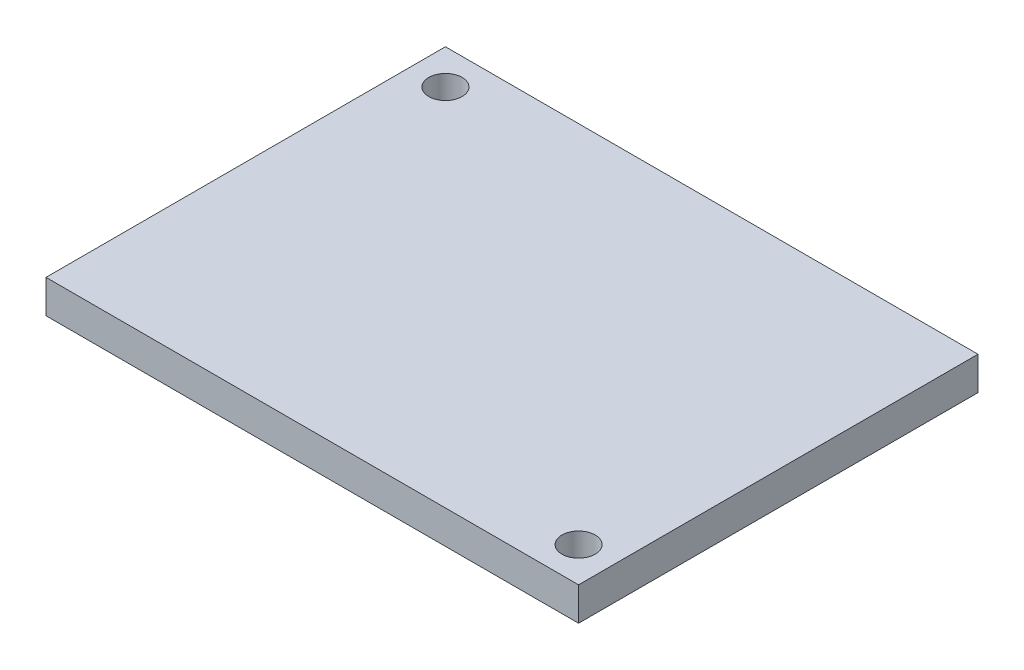
ISO-10303-21;
HEADER;
FILE_DESCRIPTION(('STEP AP214'),'2;1');
FILE_NAME('part.step','',(''),(''),'','','');
FILE_SCHEMA(('AUTOMOTIVE_DESIGN { 1 0 10303 214 1 1 1 1 }'));
ENDSEC;
DATA;
#1=APPLICATION_CONTEXT('core data for automotive mechanical design processes');
#2=APPLICATION_PROTOCOL_DEFINITION('international standard','automotive_design',2000,#1);
#3=PRODUCT_CONTEXT('',#1,'mechanical');
#4=PRODUCT('Part','Part','',(#3));
#5=PRODUCT_RELATED_PRODUCT_CATEGORY('part','',(#4));
#6=PRODUCT_DEFINITION_FORMATION('','',#4);
#7=PRODUCT_DEFINITION_CONTEXT('part definition',#1,'design');
#8=PRODUCT_DEFINITION('design','',#6,#7);
#9=PRODUCT_DEFINITION_SHAPE('','',#8);
#10=(LENGTH_UNIT() NAMED_UNIT(*) SI_UNIT(.MILLI.,.METRE.));
#11=(NAMED_UNIT(*) PLANE_ANGLE_UNIT() SI_UNIT($,.RADIAN.));
#12=(NAMED_UNIT(*) SI_UNIT($,.STERADIAN.) SOLID_ANGLE_UNIT());
#13=UNCERTAINTY_MEASURE_WITH_UNIT(LENGTH_MEASURE(1.E-05),#10,'distance_accuracy_value','');
#14=(GEOMETRIC_REPRESENTATION_CONTEXT(3) GLOBAL_UNCERTAINTY_ASSIGNED_CONTEXT((#13)) GLOBAL_UNIT_ASSIGNED_CONTEXT((#10,
#11,#12)) REPRESENTATION_CONTEXT('',''));
#15=CARTESIAN_POINT('',(0.,0.,0.));
#16=DIRECTION('',(0.,0.,1.));
#17=DIRECTION('',(1.,0.,0.));
#18=AXIS2_PLACEMENT_3D('',#15,#16,#17);
#19=CARTESIAN_POINT('',(0.,3.175,0.));
#20=DIRECTION('',(0.,-1.,0.));
#21=DIRECTION('',(0.,0.,-1.));
#22=AXIS2_PLACEMENT_3D('',#19,#20,#21);
#23=PLANE('',#22);
#24=DIRECTION('',(0.,0.,-1.));
#25=VECTOR('',#24,1.);
#26=CARTESIAN_POINT('',(25.4,3.175,19.05));
#27=LINE('',#26,#25);
#28=CARTESIAN_POINT('',(25.4,3.175,19.05));
#29=VERTEX_POINT('',#28);
#30=CARTESIAN_POINT('',(25.4,3.175,-19.05));
#31=VERTEX_POINT('',#30);
#32=EDGE_CURVE('E98',#29,#31,#27,.T.);
#33=ORIENTED_EDGE('',*,*,#32,.T.);
#34=DIRECTION('',(-1.,0.,0.));
#35=VECTOR('',#34,1.);
#36=CARTESIAN_POINT('',(-25.4,3.175,-19.05));
#37=LINE('',#36,#35);
#38=CARTESIAN_POINT('',(-25.4,3.175,-19.05));
#39=VERTEX_POINT('',#38);
#40=EDGE_CURVE('E93',#31,#39,#37,.T.);
#41=ORIENTED_EDGE('',*,*,#40,.T.);
#42=DIRECTION('',(0.,0.,1.));
#43=VECTOR('',#42,1.);
#44=CARTESIAN_POINT('',(-25.4,3.175,19.05));
#45=LINE('',#44,#43);
#46=CARTESIAN_POINT('',(-25.4,3.175,19.05));
#47=VERTEX_POINT('',#46);
#48=EDGE_CURVE('E96',#39,#47,#45,.T.);
#49=ORIENTED_EDGE('',*,*,#48,.T.);
#50=DIRECTION('',(1.,0.,0.));
#51=VECTOR('',#50,1.);
#52=CARTESIAN_POINT('',(-25.4,3.175,19.05));
#53=LINE('',#52,#51);
#54=EDGE_CURVE('E63',#47,#29,#53,.T.);
#55=ORIENTED_EDGE('',*,*,#54,.T.);
#56=EDGE_LOOP('',(#33,#41,#49,#55));
#57=FACE_BOUND('',#56,.T.);
#58=CARTESIAN_POINT('',(-22.07514,3.175,-15.72514));
#59=DIRECTION('',(0.,1.,0.));
#60=DIRECTION('',(0.,0.,1.));
#61=AXIS2_PLACEMENT_3D('',#58,#59,#60);
#62=CIRCLE('',#61,1.5875);
#63=CARTESIAN_POINT('',(-22.07514,3.175,-14.13764));
#64=VERTEX_POINT('',#63);
#65=EDGE_CURVE('E118',#64,#64,#62,.T.);
#66=ORIENTED_EDGE('',*,*,#65,.F.);
#67=EDGE_LOOP('',(#66));
#68=FACE_BOUND('',#67,.T.);
#69=CARTESIAN_POINT('',(22.07514,3.175,15.72514));
#70=DIRECTION('',(0.,1.,0.));
#71=DIRECTION('',(0.,0.,1.));
#72=AXIS2_PLACEMENT_3D('',#69,#70,#71);
#73=CIRCLE('',#72,1.5875);
#74=CARTESIAN_POINT('',(22.07514,3.175,17.31264));
#75=VERTEX_POINT('',#74);
#76=EDGE_CURVE('E140',#75,#75,#73,.T.);
#77=ORIENTED_EDGE('',*,*,#76,.F.);
#78=EDGE_LOOP('',(#77));
#79=FACE_BOUND('',#78,.T.);
#80=ADVANCED_FACE('F45',(#57,#68,#79),#23,.F.);
#81=CARTESIAN_POINT('',(0.,0.,0.));
#82=DIRECTION('',(0.,-1.,0.));
#83=DIRECTION('',(0.,0.,-1.));
#84=AXIS2_PLACEMENT_3D('',#81,#82,#83);
#85=PLANE('',#84);
#86=CARTESIAN_POINT('',(-22.07514,0.,-15.72514));
#87=DIRECTION('',(0.,1.,0.));
#88=DIRECTION('',(0.,0.,1.));
#89=AXIS2_PLACEMENT_3D('',#86,#87,#88);
#90=CIRCLE('',#89,1.5875);
#91=CARTESIAN_POINT('',(-22.07514,0.,-14.13764));
#92=VERTEX_POINT('',#91);
#93=EDGE_CURVE('E136',#92,#92,#90,.T.);
#94=ORIENTED_EDGE('',*,*,#93,.T.);
#95=EDGE_LOOP('',(#94));
#96=FACE_BOUND('',#95,.T.);
#97=DIRECTION('',(0.,0.,-1.));
#98=VECTOR('',#97,1.);
#99=CARTESIAN_POINT('',(25.4,0.,19.05));
#100=LINE('',#99,#98);
#101=CARTESIAN_POINT('',(25.4,0.,19.05));
#102=VERTEX_POINT('',#101);
#103=CARTESIAN_POINT('',(25.4,0.,-19.05));
#104=VERTEX_POINT('',#103);
#105=EDGE_CURVE('E114',#102,#104,#100,.T.);
#106=ORIENTED_EDGE('',*,*,#105,.F.);
#107=DIRECTION('',(1.,0.,0.));
#108=VECTOR('',#107,1.);
#109=CARTESIAN_POINT('',(-25.4,0.,19.05));
#110=LINE('',#109,#108);
#111=CARTESIAN_POINT('',(-25.4,0.,19.05));
#112=VERTEX_POINT('',#111);
#113=EDGE_CURVE('E86',#112,#102,#110,.T.);
#114=ORIENTED_EDGE('',*,*,#113,.F.);
#115=DIRECTION('',(0.,0.,1.));
#116=VECTOR('',#115,1.);
#117=CARTESIAN_POINT('',(-25.4,0.,19.05));
#118=LINE('',#117,#116);
#119=CARTESIAN_POINT('',(-25.4,0.,-19.05));
#120=VERTEX_POINT('',#119);
#121=EDGE_CURVE('E80',#120,#112,#118,.T.);
#122=ORIENTED_EDGE('',*,*,#121,.F.);
#123=DIRECTION('',(-1.,0.,0.));
#124=VECTOR('',#123,1.);
#125=CARTESIAN_POINT('',(-25.4,0.,-19.05));
#126=LINE('',#125,#124);
#127=EDGE_CURVE('E103',#104,#120,#126,.T.);
#128=ORIENTED_EDGE('',*,*,#127,.F.);
#129=EDGE_LOOP('',(#106,#114,#122,#128));
#130=FACE_BOUND('',#129,.T.);
#131=CARTESIAN_POINT('',(22.07514,0.,15.72514));
#132=DIRECTION('',(0.,1.,0.));
#133=DIRECTION('',(0.,0.,1.));
#134=AXIS2_PLACEMENT_3D('',#131,#132,#133);
#135=CIRCLE('',#134,1.5875);
#136=CARTESIAN_POINT('',(22.07514,0.,17.31264));
#137=VERTEX_POINT('',#136);
#138=EDGE_CURVE('E144',#137,#137,#135,.T.);
#139=ORIENTED_EDGE('',*,*,#138,.T.);
#140=EDGE_LOOP('',(#139));
#141=FACE_BOUND('',#140,.T.);
#142=ADVANCED_FACE('F131',(#96,#130,#141),#85,.T.);
#143=CARTESIAN_POINT('',(25.4,3.175,19.05));
#144=DIRECTION('',(-1.,0.,0.));
#145=DIRECTION('',(0.,0.,1.));
#146=AXIS2_PLACEMENT_3D('',#143,#144,#145);
#147=PLANE('',#146);
#148=ORIENTED_EDGE('',*,*,#105,.T.);
#149=DIRECTION('',(0.,-1.,0.));
#150=VECTOR('',#149,1.);
#151=CARTESIAN_POINT('',(25.4,3.175,-19.05));
#152=LINE('',#151,#150);
#153=EDGE_CURVE('E11',#31,#104,#152,.T.);
#154=ORIENTED_EDGE('',*,*,#153,.F.);
#155=ORIENTED_EDGE('',*,*,#32,.F.);
#156=DIRECTION('',(0.,-1.,0.));
#157=VECTOR('',#156,1.);
#158=CARTESIAN_POINT('',(25.4,3.175,19.05));
#159=LINE('',#158,#157);
#160=EDGE_CURVE('E110',#29,#102,#159,.T.);
#161=ORIENTED_EDGE('',*,*,#160,.T.);
#162=EDGE_LOOP('',(#148,#154,#155,#161));
#163=FACE_BOUND('',#162,.T.);
#164=ADVANCED_FACE('F47',(#163),#147,.F.);
#165=CARTESIAN_POINT('',(-25.4,3.175,-19.05));
#166=DIRECTION('',(0.,0.,1.));
#167=DIRECTION('',(1.,0.,0.));
#168=AXIS2_PLACEMENT_3D('',#165,#166,#167);
#169=PLANE('',#168);
#170=ORIENTED_EDGE('',*,*,#127,.T.);
#171=DIRECTION('',(0.,-1.,0.));
#172=VECTOR('',#171,1.);
#173=CARTESIAN_POINT('',(-25.4,3.175,-19.05));
#174=LINE('',#173,#172);
#175=EDGE_CURVE('E55',#39,#120,#174,.T.);
#176=ORIENTED_EDGE('',*,*,#175,.F.);
#177=ORIENTED_EDGE('',*,*,#40,.F.);
#178=ORIENTED_EDGE('',*,*,#153,.T.);
#179=EDGE_LOOP('',(#170,#176,#177,#178));
#180=FACE_BOUND('',#179,.T.);
#181=ADVANCED_FACE('F102',(#180),#169,.F.);
#182=CARTESIAN_POINT('',(-25.4,3.175,19.05));
#183=DIRECTION('',(1.,0.,0.));
#184=DIRECTION('',(0.,0.,-1.));
#185=AXIS2_PLACEMENT_3D('',#182,#183,#184);
#186=PLANE('',#185);
#187=ORIENTED_EDGE('',*,*,#121,.T.);
#188=DIRECTION('',(0.,-1.,0.));
#189=VECTOR('',#188,1.);
#190=CARTESIAN_POINT('',(-25.4,3.175,19.05));
#191=LINE('',#190,#189);
#192=EDGE_CURVE('E105',#47,#112,#191,.T.);
#193=ORIENTED_EDGE('',*,*,#192,.F.);
#194=ORIENTED_EDGE('',*,*,#48,.F.);
#195=ORIENTED_EDGE('',*,*,#175,.T.);
#196=EDGE_LOOP('',(#187,#193,#194,#195));
#197=FACE_BOUND('',#196,.T.);
#198=ADVANCED_FACE('F106',(#197),#186,.F.);
#199=CARTESIAN_POINT('',(-25.4,3.175,19.05));
#200=DIRECTION('',(0.,0.,-1.));
#201=DIRECTION('',(-1.,0.,0.));
#202=AXIS2_PLACEMENT_3D('',#199,#200,#201);
#203=PLANE('',#202);
#204=ORIENTED_EDGE('',*,*,#113,.T.);
#205=ORIENTED_EDGE('',*,*,#160,.F.);
#206=ORIENTED_EDGE('',*,*,#54,.F.);
#207=ORIENTED_EDGE('',*,*,#192,.T.);
#208=EDGE_LOOP('',(#204,#205,#206,#207));
#209=FACE_BOUND('',#208,.T.);
#210=ADVANCED_FACE('F128',(#209),#203,.F.);
#211=CARTESIAN_POINT('',(-22.07514,3.175,-15.72514));
#212=DIRECTION('',(0.,-1.,0.));
#213=DIRECTION('',(0.,0.,-1.));
#214=AXIS2_PLACEMENT_3D('',#211,#212,#213);
#215=CYLINDRICAL_SURFACE('',#214,1.5875);
#216=ORIENTED_EDGE('',*,*,#65,.T.);
#217=EDGE_LOOP('',(#216));
#218=FACE_BOUND('',#217,.T.);
#219=ORIENTED_EDGE('',*,*,#93,.F.);
#220=EDGE_LOOP('',(#219));
#221=FACE_BOUND('',#220,.T.);
#222=ADVANCED_FACE('F163',(#218,#221),#215,.F.);
#223=CARTESIAN_POINT('',(22.07514,3.175,15.72514));
#224=DIRECTION('',(0.,-1.,0.));
#225=DIRECTION('',(0.,0.,-1.));
#226=AXIS2_PLACEMENT_3D('',#223,#224,#225);
#227=CYLINDRICAL_SURFACE('',#226,1.5875);
#228=ORIENTED_EDGE('',*,*,#76,.T.);
#229=EDGE_LOOP('',(#228));
#230=FACE_BOUND('',#229,.T.);
#231=ORIENTED_EDGE('',*,*,#138,.F.);
#232=EDGE_LOOP('',(#231));
#233=FACE_BOUND('',#232,.T.);
#234=ADVANCED_FACE('F152',(#230,#233),#227,.F.);
#235=CLOSED_SHELL('',(#80,#142,#164,#181,#198,#210,#222,#234));
#236=MANIFOLD_SOLID_BREP('B2',#235);
#237=ADVANCED_BREP_SHAPE_REPRESENTATION('',(#18,#236),#14);
#238=SHAPE_DEFINITION_REPRESENTATION(#9,#237);
ENDSEC;
END-ISO-10303-21;
